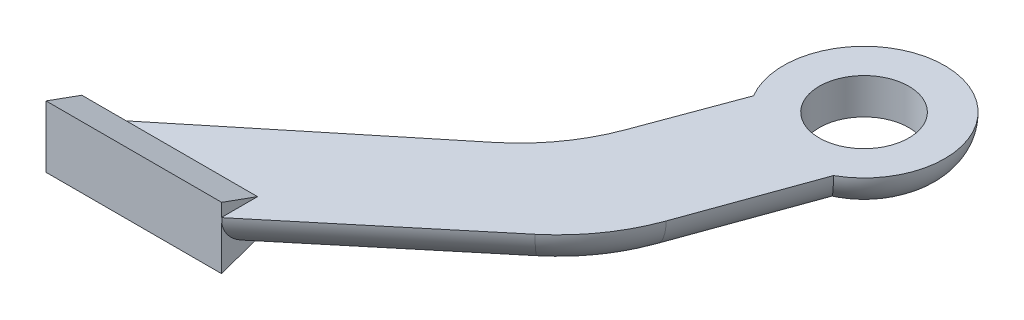
ISO-10303-21;
HEADER;
FILE_DESCRIPTION(('STEP AP214'),'2;1');
FILE_NAME('part.step','',(''),(''),'','','');
FILE_SCHEMA(('AUTOMOTIVE_DESIGN { 1 0 10303 214 1 1 1 1 }'));
ENDSEC;
DATA;
#1=APPLICATION_CONTEXT('core data for automotive mechanical design processes');
#2=APPLICATION_PROTOCOL_DEFINITION('international standard','automotive_design',2000,#1);
#3=PRODUCT_CONTEXT('',#1,'mechanical');
#4=PRODUCT('Part','Part','',(#3));
#5=PRODUCT_RELATED_PRODUCT_CATEGORY('part','',(#4));
#6=PRODUCT_DEFINITION_FORMATION('','',#4);
#7=PRODUCT_DEFINITION_CONTEXT('part definition',#1,'design');
#8=PRODUCT_DEFINITION('design','',#6,#7);
#9=PRODUCT_DEFINITION_SHAPE('','',#8);
#10=(LENGTH_UNIT() NAMED_UNIT(*) SI_UNIT(.MILLI.,.METRE.));
#11=(NAMED_UNIT(*) PLANE_ANGLE_UNIT() SI_UNIT($,.RADIAN.));
#12=(NAMED_UNIT(*) SI_UNIT($,.STERADIAN.) SOLID_ANGLE_UNIT());
#13=UNCERTAINTY_MEASURE_WITH_UNIT(LENGTH_MEASURE(1.E-05),#10,'distance_accuracy_value','');
#14=(GEOMETRIC_REPRESENTATION_CONTEXT(3) GLOBAL_UNCERTAINTY_ASSIGNED_CONTEXT((#13)) GLOBAL_UNIT_ASSIGNED_CONTEXT((#10,
#11,#12)) REPRESENTATION_CONTEXT('',''));
#15=CARTESIAN_POINT('',(0.,0.,0.));
#16=DIRECTION('',(0.,0.,1.));
#17=DIRECTION('',(1.,0.,0.));
#18=AXIS2_PLACEMENT_3D('',#15,#16,#17);
#19=CARTESIAN_POINT('',(11.4826257965562,2.,-14.3996307201945));
#20=DIRECTION('',(0.,1.,0.));
#21=DIRECTION('',(0.,0.,1.));
#22=AXIS2_PLACEMENT_3D('',#19,#20,#21);
#23=PLANE('',#22);
#24=DIRECTION('',(1.,0.,0.));
#25=VECTOR('',#24,1.);
#26=CARTESIAN_POINT('',(-11.15,2.,6.60036927980545));
#27=LINE('',#26,#25);
#28=CARTESIAN_POINT('',(-8.67203805305271,2.,6.60036927980545));
#29=VERTEX_POINT('',#28);
#30=CARTESIAN_POINT('',(-1.35,2.,6.60036927980545));
#31=VERTEX_POINT('',#30);
#32=EDGE_CURVE('E181',#29,#31,#27,.T.);
#33=ORIENTED_EDGE('',*,*,#32,.T.);
#34=DIRECTION('',(0.,0.,1.));
#35=VECTOR('',#34,1.);
#36=CARTESIAN_POINT('',(-1.35,2.,-14.3996307201945));
#37=LINE('',#36,#35);
#38=CARTESIAN_POINT('',(-1.35,2.,8.60036927980545));
#39=VERTEX_POINT('',#38);
#40=EDGE_CURVE('E178',#31,#39,#37,.T.);
#41=ORIENTED_EDGE('',*,*,#40,.T.);
#42=DIRECTION('',(1.,0.,0.));
#43=VECTOR('',#42,1.);
#44=CARTESIAN_POINT('',(-11.1234241734397,2.,8.60036927980545));
#45=LINE('',#44,#43);
#46=CARTESIAN_POINT('',(-1.31921636014026,2.,8.60036927980545));
#47=VERTEX_POINT('',#46);
#48=EDGE_CURVE('E199',#39,#47,#45,.T.);
#49=ORIENTED_EDGE('',*,*,#48,.T.);
#50=DIRECTION('',(0.768811989561023,0.,-0.639474881998676));
#51=VECTOR('',#50,1.);
#52=CARTESIAN_POINT('',(-1.31921636014026,2.,8.60036927980545));
#53=LINE('',#52,#51);
#54=CARTESIAN_POINT('',(8.20702119077927,2.,0.676729018622842));
#55=VERTEX_POINT('',#54);
#56=EDGE_CURVE('E202',#47,#55,#53,.T.);
#57=ORIENTED_EDGE('',*,*,#56,.T.);
#58=CARTESIAN_POINT('',(1.8122723707925,2.,-7.01139087698739));
#59=DIRECTION('',(0.,1.,0.));
#60=DIRECTION('',(0.,0.,1.));
#61=AXIS2_PLACEMENT_3D('',#58,#59,#60);
#62=CIRCLE('',#61,10.);
#63=CARTESIAN_POINT('',(11.2193056553227,2.,-3.6190871194002));
#64=VERTEX_POINT('',#63);
#65=EDGE_CURVE('E210',#55,#64,#62,.T.);
#66=ORIENTED_EDGE('',*,*,#65,.T.);
#67=DIRECTION('',(0.339230375758719,0.,-0.940703328453024));
#68=VECTOR('',#67,1.);
#69=CARTESIAN_POINT('',(10.2970860518292,2.,-1.06172459362196));
#70=LINE('',#69,#68);
#71=CARTESIAN_POINT('',(13.693514413313,2.,-10.4801956174922));
#72=VERTEX_POINT('',#71);
#73=EDGE_CURVE('E204',#64,#72,#70,.T.);
#74=ORIENTED_EDGE('',*,*,#73,.T.);
#75=CARTESIAN_POINT('',(11.4826257965562,2.,-14.3996307201945));
#76=DIRECTION('',(0.,1.,0.));
#77=DIRECTION('',(0.,0.,1.));
#78=AXIS2_PLACEMENT_3D('',#75,#76,#77);
#79=CIRCLE('',#78,4.5);
#80=CARTESIAN_POINT('',(7.61190342688268,2.,-12.1045254204515));
#81=VERTEX_POINT('',#80);
#82=EDGE_CURVE('E207',#72,#81,#79,.T.);
#83=ORIENTED_EDGE('',*,*,#82,.T.);
#84=DIRECTION('',(-0.347398248181745,0.,0.937717685212482));
#85=VECTOR('',#84,1.);
#86=CARTESIAN_POINT('',(7.61190342688268,2.,-12.1045254204515));
#87=LINE('',#86,#85);
#88=CARTESIAN_POINT('',(5.68031595775114,2.,-6.89067146517223));
#89=VERTEX_POINT('',#88);
#90=EDGE_CURVE('E190',#81,#89,#87,.T.);
#91=ORIENTED_EDGE('',*,*,#90,.T.);
#92=CARTESIAN_POINT('',(-3.69686089437368,2.,-10.3646539469897));
#93=DIRECTION('',(0.,1.,0.));
#94=DIRECTION('',(0.,0.,1.));
#95=AXIS2_PLACEMENT_3D('',#92,#93,#94);
#96=CIRCLE('',#95,10.);
#97=CARTESIAN_POINT('',(2.62475748019861,2.,-2.61629017608488));
#98=VERTEX_POINT('',#97);
#99=EDGE_CURVE('E212',#89,#98,#96,.F.);
#100=ORIENTED_EDGE('',*,*,#99,.T.);
#101=DIRECTION('',(-0.77483637709048,0.,0.632161837457229));
#102=VECTOR('',#101,1.);
#103=CARTESIAN_POINT('',(4.73443918794363,2.,-4.33750552457679));
#104=LINE('',#103,#102);
#105=EDGE_CURVE('E196',#98,#29,#104,.T.);
#106=ORIENTED_EDGE('',*,*,#105,.T.);
#107=EDGE_LOOP('',(#33,#41,#49,#57,#66,#74,#83,#91,#100,#106));
#108=FACE_BOUND('',#107,.T.);
#109=CARTESIAN_POINT('',(11.4826257965562,2.,-14.3996307201945));
#110=DIRECTION('',(0.,1.,0.));
#111=DIRECTION('',(0.,0.,1.));
#112=AXIS2_PLACEMENT_3D('',#109,#110,#111);
#113=CIRCLE('',#112,2.5);
#114=CARTESIAN_POINT('',(11.4826257965562,2.,-11.8996307201945));
#115=VERTEX_POINT('',#114);
#116=EDGE_CURVE('E187',#115,#115,#113,.T.);
#117=ORIENTED_EDGE('',*,*,#116,.F.);
#118=EDGE_LOOP('',(#117));
#119=FACE_BOUND('',#118,.T.);
#120=ADVANCED_FACE('F36',(#108,#119),#23,.T.);
#121=CARTESIAN_POINT('',(11.4826257965562,0.,-14.3996307201945));
#122=DIRECTION('',(0.,1.,0.));
#123=DIRECTION('',(0.,0.,1.));
#124=AXIS2_PLACEMENT_3D('',#121,#122,#123);
#125=PLANE('',#124);
#126=DIRECTION('',(-0.347398248181745,0.,0.937717685212482));
#127=VECTOR('',#126,1.);
#128=CARTESIAN_POINT('',(10.7021359294715,0.,-14.6887804470523));
#129=LINE('',#128,#127);
#130=CARTESIAN_POINT('',(7.5557513281761,0.,-6.19587496880874));
#131=VERTEX_POINT('',#130);
#132=CARTESIAN_POINT('',(9.88318716538032,0.,-12.4782260087654));
#133=VERTEX_POINT('',#132);
#134=EDGE_CURVE('E57',#131,#133,#129,.F.);
#135=ORIENTED_EDGE('',*,*,#134,.T.);
#136=CARTESIAN_POINT('',(11.4826257965562,0.,-14.3996307201945));
#137=DIRECTION('',(0.,1.,0.));
#138=DIRECTION('',(0.,0.,1.));
#139=AXIS2_PLACEMENT_3D('',#136,#137,#138);
#140=CIRCLE('',#139,2.5);
#141=CARTESIAN_POINT('',(12.1079729417804,0.,-11.9791057878793));
#142=VERTEX_POINT('',#141);
#143=EDGE_CURVE('E186',#133,#142,#140,.T.);
#144=ORIENTED_EDGE('',*,*,#143,.T.);
#145=DIRECTION('',(0.339230375758719,0.,-0.940703328453024));
#146=VECTOR('',#145,1.);
#147=CARTESIAN_POINT('',(12.8084358747006,0.,-13.921525628621));
#148=LINE('',#147,#146);
#149=CARTESIAN_POINT('',(9.3378989984167,0.,-4.29754787091764));
#150=VERTEX_POINT('',#149);
#151=EDGE_CURVE('E64',#142,#150,#148,.F.);
#152=ORIENTED_EDGE('',*,*,#151,.T.);
#153=CARTESIAN_POINT('',(1.8122723707925,0.,-7.01139087698739));
#154=DIRECTION('',(0.,1.,0.));
#155=DIRECTION('',(0.,0.,1.));
#156=AXIS2_PLACEMENT_3D('',#153,#154,#155);
#157=CIRCLE('',#156,8.);
#158=CARTESIAN_POINT('',(6.92807142678192,0.,-0.860894960499205));
#159=VERTEX_POINT('',#158);
#160=EDGE_CURVE('E221',#150,#159,#157,.F.);
#161=ORIENTED_EDGE('',*,*,#160,.T.);
#162=DIRECTION('',(0.768811989561023,0.,-0.639474881998676));
#163=VECTOR('',#162,1.);
#164=CARTESIAN_POINT('',(16.2762697216083,0.,-8.63644747873922));
#165=LINE('',#164,#163);
#166=CARTESIAN_POINT('',(-2.04227215778598,0.,6.60036927980545));
#167=VERTEX_POINT('',#166);
#168=EDGE_CURVE('E219',#159,#167,#165,.F.);
#169=ORIENTED_EDGE('',*,*,#168,.T.);
#170=DIRECTION('',(1.,0.,0.));
#171=VECTOR('',#170,1.);
#172=CARTESIAN_POINT('',(-11.15,0.,6.60036927980545));
#173=LINE('',#172,#171);
#174=CARTESIAN_POINT('',(-5.50829123776774,0.,6.60036927980545));
#175=VERTEX_POINT('',#174);
#176=EDGE_CURVE('E156',#175,#167,#173,.T.);
#177=ORIENTED_EDGE('',*,*,#176,.F.);
#178=DIRECTION('',(-0.77483637709048,0.,0.632161837457229));
#179=VECTOR('',#178,1.);
#180=CARTESIAN_POINT('',(14.9788313460514,0.,-10.1143558411684));
#181=LINE('',#180,#179);
#182=CARTESIAN_POINT('',(3.88908115511307,0.,-1.06661742190392));
#183=VERTEX_POINT('',#182);
#184=EDGE_CURVE('E214',#175,#183,#181,.F.);
#185=ORIENTED_EDGE('',*,*,#184,.T.);
#186=CARTESIAN_POINT('',(-3.69686089437368,0.,-10.3646539469897));
#187=DIRECTION('',(0.,1.,0.));
#188=DIRECTION('',(0.,0.,1.));
#189=AXIS2_PLACEMENT_3D('',#186,#187,#188);
#190=CIRCLE('',#189,12.);
#191=EDGE_CURVE('E216',#183,#131,#190,.T.);
#192=ORIENTED_EDGE('',*,*,#191,.T.);
#193=EDGE_LOOP('',(#135,#144,#152,#161,#169,#177,#185,#192));
#194=FACE_BOUND('',#193,.T.);
#195=ADVANCED_FACE('F265',(#194),#125,.F.);
#196=CARTESIAN_POINT('',(-11.1234241734397,2.,8.60036927980545));
#197=DIRECTION('',(0.,0.,-1.));
#198=DIRECTION('',(-1.,0.,0.));
#199=AXIS2_PLACEMENT_3D('',#196,#197,#198);
#200=PLANE('',#199);
#201=DIRECTION('',(0.,-1.,0.));
#202=VECTOR('',#201,1.);
#203=CARTESIAN_POINT('',(-1.35,-0.725,8.60036927980545));
#204=LINE('',#203,#202);
#205=CARTESIAN_POINT('',(-1.35,1.72008225440629,8.60036927980545));
#206=VERTEX_POINT('',#205);
#207=CARTESIAN_POINT('',(-1.35,-0.725,8.60036927980545));
#208=VERTEX_POINT('',#207);
#209=EDGE_CURVE('E135',#206,#208,#204,.T.);
#210=ORIENTED_EDGE('',*,*,#209,.F.);
#211=CARTESIAN_POINT('',(-4.44678251840594,2.,8.60036927980545));
#212=DIRECTION('',(0.,0.,-1.));
#213=DIRECTION('',(1.,0.,0.));
#214=AXIS2_PLACEMENT_3D('',#211,#212,#213);
#215=ELLIPSE('',#214,3.12756615826568,2.);
#216=EDGE_CURVE('E224',#206,#47,#215,.F.);
#217=ORIENTED_EDGE('',*,*,#216,.T.);
#218=ORIENTED_EDGE('',*,*,#48,.F.);
#219=CARTESIAN_POINT('',(-1.35,2.725,8.60036927980545));
#220=VERTEX_POINT('',#219);
#221=EDGE_CURVE('E145',#220,#39,#204,.T.);
#222=ORIENTED_EDGE('',*,*,#221,.F.);
#223=DIRECTION('',(1.,0.,0.));
#224=VECTOR('',#223,1.);
#225=CARTESIAN_POINT('',(-11.15,2.725,8.60036927980545));
#226=LINE('',#225,#224);
#227=CARTESIAN_POINT('',(-11.15,2.725,8.60036927980545));
#228=VERTEX_POINT('',#227);
#229=EDGE_CURVE('E176',#228,#220,#226,.T.);
#230=ORIENTED_EDGE('',*,*,#229,.F.);
#231=DIRECTION('',(0.,-1.,0.));
#232=VECTOR('',#231,1.);
#233=CARTESIAN_POINT('',(-11.15,-0.725,8.60036927980545));
#234=LINE('',#233,#232);
#235=CARTESIAN_POINT('',(-11.15,-0.725,8.60036927980545));
#236=VERTEX_POINT('',#235);
#237=EDGE_CURVE('E152',#228,#236,#234,.T.);
#238=ORIENTED_EDGE('',*,*,#237,.T.);
#239=DIRECTION('',(1.,0.,0.));
#240=VECTOR('',#239,1.);
#241=CARTESIAN_POINT('',(-11.15,-0.725,8.60036927980545));
#242=LINE('',#241,#240);
#243=EDGE_CURVE('E149',#236,#208,#242,.T.);
#244=ORIENTED_EDGE('',*,*,#243,.T.);
#245=EDGE_LOOP('',(#210,#217,#218,#222,#230,#238,#244));
#246=FACE_BOUND('',#245,.T.);
#247=ADVANCED_FACE('F150',(#246),#200,.F.);
#248=CARTESIAN_POINT('',(11.4826257965562,2.,-14.3996307201945));
#249=DIRECTION('',(0.,-1.,0.));
#250=DIRECTION('',(0.,0.,-1.));
#251=AXIS2_PLACEMENT_3D('',#248,#249,#250);
#252=CYLINDRICAL_SURFACE('',#251,2.5);
#253=ORIENTED_EDGE('',*,*,#116,.T.);
#254=EDGE_LOOP('',(#253));
#255=FACE_BOUND('',#254,.T.);
#256=EDGE_CURVE('E191',#142,#133,#140,.T.);
#257=ORIENTED_EDGE('',*,*,#256,.F.);
#258=ORIENTED_EDGE('',*,*,#143,.F.);
#259=EDGE_LOOP('',(#257,#258));
#260=FACE_BOUND('',#259,.T.);
#261=ADVANCED_FACE('F275',(#255,#260),#252,.F.);
#262=CARTESIAN_POINT('',(-11.15,2.,6.60036927980545));
#263=DIRECTION('',(0.,0.,-1.));
#264=DIRECTION('',(-1.,0.,0.));
#265=AXIS2_PLACEMENT_3D('',#262,#263,#264);
#266=PLANE('',#265);
#267=CARTESIAN_POINT('',(-11.15,2.,6.60036927980545));
#268=VERTEX_POINT('',#267);
#269=EDGE_CURVE('E179',#268,#29,#27,.T.);
#270=ORIENTED_EDGE('',*,*,#269,.T.);
#271=CARTESIAN_POINT('',(-5.50829123776774,2.,6.60036927980545));
#272=DIRECTION('',(0.,0.,-1.));
#273=DIRECTION('',(-1.,0.,0.));
#274=AXIS2_PLACEMENT_3D('',#271,#272,#273);
#275=ELLIPSE('',#274,3.16374681528496,2.);
#276=EDGE_CURVE('E228',#29,#175,#275,.F.);
#277=ORIENTED_EDGE('',*,*,#276,.T.);
#278=CARTESIAN_POINT('',(-11.15,0.,6.60036927980545));
#279=VERTEX_POINT('',#278);
#280=EDGE_CURVE('E182',#279,#175,#173,.T.);
#281=ORIENTED_EDGE('',*,*,#280,.F.);
#282=DIRECTION('',(0.,1.,0.));
#283=VECTOR('',#282,1.);
#284=CARTESIAN_POINT('',(-11.15,2.,6.60036927980545));
#285=LINE('',#284,#283);
#286=EDGE_CURVE('E171',#279,#268,#285,.T.);
#287=ORIENTED_EDGE('',*,*,#286,.T.);
#288=EDGE_LOOP('',(#270,#277,#281,#287));
#289=FACE_BOUND('',#288,.T.);
#290=ADVANCED_FACE('F296',(#289),#266,.T.);
#291=CARTESIAN_POINT('',(-1.35,0.,0.));
#292=DIRECTION('',(-1.,0.,0.));
#293=DIRECTION('',(0.,0.,1.));
#294=AXIS2_PLACEMENT_3D('',#291,#292,#293);
#295=PLANE('',#294);
#296=DIRECTION('',(0.,0.3407993236214,-0.940136065162483));
#297=VECTOR('',#296,1.);
#298=CARTESIAN_POINT('',(-1.35,0.,6.60036927980545));
#299=LINE('',#298,#297);
#300=CARTESIAN_POINT('',(-1.35,0.0344519870253964,6.50532931559746));
#301=VERTEX_POINT('',#300);
#302=EDGE_CURVE('E139',#208,#301,#299,.T.);
#303=ORIENTED_EDGE('',*,*,#302,.T.);
#304=CARTESIAN_POINT('',(-1.35,2.,6.0245579469672));
#305=DIRECTION('',(-1.,0.,0.));
#306=DIRECTION('',(0.,0.,-1.));
#307=AXIS2_PLACEMENT_3D('',#304,#305,#306);
#308=ELLIPSE('',#307,2.60141624630745,2.);
#309=EDGE_CURVE('E142',#301,#206,#308,.T.);
#310=ORIENTED_EDGE('',*,*,#309,.T.);
#311=ORIENTED_EDGE('',*,*,#209,.T.);
#312=EDGE_LOOP('',(#303,#310,#311));
#313=FACE_BOUND('',#312,.T.);
#314=ADVANCED_FACE('F137',(#313),#295,.F.);
#315=CARTESIAN_POINT('',(-11.15,2.725,8.60036927980545));
#316=DIRECTION('',(0.,0.940136065162483,-0.3407993236214));
#317=DIRECTION('',(0.,0.3407993236214,0.940136065162483));
#318=AXIS2_PLACEMENT_3D('',#315,#316,#317);
#319=PLANE('',#318);
#320=ORIENTED_EDGE('',*,*,#229,.T.);
#321=DIRECTION('',(0.,0.3407993236214,0.940136065162483));
#322=VECTOR('',#321,1.);
#323=CARTESIAN_POINT('',(-1.35,2.725,8.60036927980545));
#324=LINE('',#323,#322);
#325=EDGE_CURVE('E163',#31,#220,#324,.T.);
#326=ORIENTED_EDGE('',*,*,#325,.F.);
#327=ORIENTED_EDGE('',*,*,#32,.F.);
#328=ORIENTED_EDGE('',*,*,#269,.F.);
#329=DIRECTION('',(0.,0.3407993236214,0.940136065162483));
#330=VECTOR('',#329,1.);
#331=CARTESIAN_POINT('',(-11.15,2.725,8.60036927980545));
#332=LINE('',#331,#330);
#333=EDGE_CURVE('E157',#268,#228,#332,.T.);
#334=ORIENTED_EDGE('',*,*,#333,.T.);
#335=EDGE_LOOP('',(#320,#326,#327,#328,#334));
#336=FACE_BOUND('',#335,.T.);
#337=ADVANCED_FACE('F302',(#336),#319,.T.);
#338=CARTESIAN_POINT('',(-11.15,0.,6.60036927980545));
#339=DIRECTION('',(0.,-0.940136065162483,-0.3407993236214));
#340=DIRECTION('',(0.,0.3407993236214,-0.940136065162483));
#341=AXIS2_PLACEMENT_3D('',#338,#339,#340);
#342=PLANE('',#341);
#343=ORIENTED_EDGE('',*,*,#280,.T.);
#344=ORIENTED_EDGE('',*,*,#176,.T.);
#345=CARTESIAN_POINT('',(4.59085987151048,2.,1.0831279004951));
#346=DIRECTION('',(0.,-0.940136065162483,-0.3407993236214));
#347=DIRECTION('',(0.787746403612043,0.209932273696439,-0.57912351364535));
#348=AXIS2_PLACEMENT_3D('',#345,#346,#347);
#349=ELLIPSE('',#348,9.17714895977948,2.);
#350=EDGE_CURVE('E162',#167,#301,#349,.F.);
#351=ORIENTED_EDGE('',*,*,#350,.T.);
#352=ORIENTED_EDGE('',*,*,#302,.F.);
#353=ORIENTED_EDGE('',*,*,#243,.F.);
#354=DIRECTION('',(0.,0.3407993236214,-0.940136065162483));
#355=VECTOR('',#354,1.);
#356=CARTESIAN_POINT('',(-11.15,0.,6.60036927980545));
#357=LINE('',#356,#355);
#358=EDGE_CURVE('E169',#236,#279,#357,.T.);
#359=ORIENTED_EDGE('',*,*,#358,.T.);
#360=EDGE_LOOP('',(#343,#344,#351,#352,#353,#359));
#361=FACE_BOUND('',#360,.T.);
#362=ADVANCED_FACE('F159',(#361),#342,.T.);
#363=CARTESIAN_POINT('',(-11.15,0.,0.));
#364=DIRECTION('',(-1.,0.,0.));
#365=DIRECTION('',(0.,0.,1.));
#366=AXIS2_PLACEMENT_3D('',#363,#364,#365);
#367=PLANE('',#366);
#368=ORIENTED_EDGE('',*,*,#237,.F.);
#369=ORIENTED_EDGE('',*,*,#333,.F.);
#370=ORIENTED_EDGE('',*,*,#286,.F.);
#371=ORIENTED_EDGE('',*,*,#358,.F.);
#372=EDGE_LOOP('',(#368,#369,#370,#371));
#373=FACE_BOUND('',#372,.T.);
#374=ADVANCED_FACE('F300',(#373),#367,.T.);
#375=ORIENTED_EDGE('',*,*,#40,.F.);
#376=ORIENTED_EDGE('',*,*,#325,.T.);
#377=ORIENTED_EDGE('',*,*,#221,.T.);
#378=EDGE_LOOP('',(#375,#376,#377));
#379=FACE_BOUND('',#378,.T.);
#380=ADVANCED_FACE('F285',(#379),#295,.F.);
#381=CARTESIAN_POINT('',(-2.59816612413761,2.,7.0627453006834));
#382=DIRECTION('',(0.768811989561023,0.,-0.639474881998676));
#383=DIRECTION('',(-0.639474881998676,0.,-0.768811989561023));
#384=AXIS2_PLACEMENT_3D('',#381,#382,#383);
#385=CYLINDRICAL_SURFACE('',#384,2.);
#386=ORIENTED_EDGE('',*,*,#350,.F.);
#387=ORIENTED_EDGE('',*,*,#168,.F.);
#388=CARTESIAN_POINT('',(6.92807142678192,2.,-0.860894960499205));
#389=DIRECTION('',(0.768811989561023,0.,-0.639474881998676));
#390=DIRECTION('',(-0.639474881998676,0.,-0.768811989561023));
#391=AXIS2_PLACEMENT_3D('',#388,#389,#390);
#392=CIRCLE('',#391,2.);
#393=EDGE_CURVE('E146',#55,#159,#392,.T.);
#394=ORIENTED_EDGE('',*,*,#393,.F.);
#395=ORIENTED_EDGE('',*,*,#56,.F.);
#396=ORIENTED_EDGE('',*,*,#216,.F.);
#397=ORIENTED_EDGE('',*,*,#309,.F.);
#398=EDGE_LOOP('',(#386,#387,#394,#395,#396,#397));
#399=FACE_BOUND('',#398,.T.);
#400=ADVANCED_FACE('F251',(#399),#385,.T.);
#401=CARTESIAN_POINT('',(1.8122723707925,2.,-7.01139087698739));
#402=DIRECTION('',(0.,1.,0.));
#403=DIRECTION('',(0.,0.,1.));
#404=AXIS2_PLACEMENT_3D('',#401,#402,#403);
#405=TOROIDAL_SURFACE('',#404,8.,2.);
#406=ORIENTED_EDGE('',*,*,#393,.T.);
#407=ORIENTED_EDGE('',*,*,#160,.F.);
#408=CARTESIAN_POINT('',(9.3378989984167,2.,-4.29754787091764));
#409=DIRECTION('',(0.339230375758719,0.,-0.940703328453024));
#410=DIRECTION('',(-0.940703328453024,0.,-0.339230375758719));
#411=AXIS2_PLACEMENT_3D('',#408,#409,#410);
#412=CIRCLE('',#411,2.);
#413=EDGE_CURVE('E231',#64,#150,#412,.T.);
#414=ORIENTED_EDGE('',*,*,#413,.F.);
#415=ORIENTED_EDGE('',*,*,#65,.F.);
#416=EDGE_LOOP('',(#406,#407,#414,#415));
#417=FACE_BOUND('',#416,.T.);
#418=ADVANCED_FACE('F262',(#417),#405,.T.);
#419=CARTESIAN_POINT('',(8.41567939492314,2.,-1.7401853451394));
#420=DIRECTION('',(0.339230375758719,0.,-0.940703328453024));
#421=DIRECTION('',(-0.940703328453024,0.,-0.339230375758719));
#422=AXIS2_PLACEMENT_3D('',#419,#420,#421);
#423=CYLINDRICAL_SURFACE('',#422,2.);
#424=ORIENTED_EDGE('',*,*,#413,.T.);
#425=ORIENTED_EDGE('',*,*,#151,.F.);
#426=CARTESIAN_POINT('',(13.693514413313,2.,-10.4801956174922));
#427=CARTESIAN_POINT('',(13.6935206015833,1.94647094845797,-10.4801920632802));
#428=CARTESIAN_POINT('',(13.6917636364918,1.89294525970464,-10.4816752709105));
#429=CARTESIAN_POINT('',(13.6847706272418,1.78629295991481,-10.4875874777269));
#430=CARTESIAN_POINT('',(13.6795350977507,1.7331662910175,-10.4920160411361));
#431=CARTESIAN_POINT('',(13.6656469622341,1.62780060898106,-10.5037787069259));
#432=CARTESIAN_POINT('',(13.6570016554297,1.57555994672415,-10.5111066028867));
#433=CARTESIAN_POINT('',(13.6363943848645,1.47223655971397,-10.5286070655638));
#434=CARTESIAN_POINT('',(13.6244323997996,1.42115384240081,-10.5387796505525));
#435=CARTESIAN_POINT('',(13.5837393605981,1.27018038251834,-10.5734676457845));
#436=CARTESIAN_POINT('',(13.5501882878966,1.17246774766914,-10.6021641468197));
#437=CARTESIAN_POINT('',(13.4716192624409,0.985678518852981,-10.6698749951854));
#438=CARTESIAN_POINT('',(13.4265992827097,0.896603455308139,-10.7088911664272));
#439=CARTESIAN_POINT('',(13.3257203823923,0.727334799373857,-10.7971814060579));
#440=CARTESIAN_POINT('',(13.2696490582893,0.647373586018656,-10.8466581543752));
#441=CARTESIAN_POINT('',(13.1493973648619,0.500311076124678,-10.9541068178581));
#442=CARTESIAN_POINT('',(13.0852150322487,0.433212903045907,-11.0120807903417));
#443=CARTESIAN_POINT('',(12.9471257908999,0.309609195597523,-11.1387261646872));
#444=CARTESIAN_POINT('',(12.8728736116376,0.253921664797636,-11.2078181125366));
#445=CARTESIAN_POINT('',(12.7203459894761,0.158907196256941,-11.3525316463373));
#446=CARTESIAN_POINT('',(12.6420687196115,0.119587762876743,-11.4281562081838));
#447=CARTESIAN_POINT('',(12.4882816488727,0.0591602497511942,-11.5802164512471));
#448=CARTESIAN_POINT('',(12.412847993636,0.0371900149889169,-11.6563920333859));
#449=CARTESIAN_POINT('',(12.2627109958039,0.0078428192906722,-11.811982496122));
#450=CARTESIAN_POINT('',(12.1880065576385,0.000438850248578032,-11.891391102499));
#451=CARTESIAN_POINT('',(12.11239205861,6.29203840483205E-06,-11.9742562173392));
#452=CARTESIAN_POINT('',(12.1101818959228,-1.95465007629301E-08,-11.9766805427118));
#453=CARTESIAN_POINT('',(12.1079729417804,0.,-11.9791057878793));
#454=B_SPLINE_CURVE_WITH_KNOTS('',3,(#426,#427,#428,#429,#430,#431,#432,#433,#434,#435,#436,
#437,#438,#439,#440,#441,#442,#443,#444,#445,#446,#447,#448,#449,#450,#451,#452,#453),
.UNSPECIFIED.,.F.,.F.,(4,2,2,2,2,2,2,2,2,2,2,2,2,4),(0.,0.16053195849016,0.321040170924062,
0.481206636430516,0.641374130760215,0.961418689782529,1.28151985172015,1.60850954501276,
1.93557853908486,2.28122266166902,2.62702507931526,2.95431744541945,3.28100238685324,
3.29084409847999),.UNSPECIFIED.);
#455=EDGE_CURVE('E11',#142,#72,#454,.F.);
#456=ORIENTED_EDGE('',*,*,#455,.T.);
#457=ORIENTED_EDGE('',*,*,#73,.F.);
#458=EDGE_LOOP('',(#424,#425,#456,#457));
#459=FACE_BOUND('',#458,.T.);
#460=ADVANCED_FACE('F257',(#459),#423,.T.);
#461=CARTESIAN_POINT('',(5.99876286285809,2.,-2.78783277039583));
#462=DIRECTION('',(-0.77483637709048,0.,0.632161837457229));
#463=DIRECTION('',(0.632161837457229,0.,0.77483637709048));
#464=AXIS2_PLACEMENT_3D('',#461,#462,#463);
#465=CYLINDRICAL_SURFACE('',#464,2.);
#466=ORIENTED_EDGE('',*,*,#276,.F.);
#467=ORIENTED_EDGE('',*,*,#105,.F.);
#468=CARTESIAN_POINT('',(3.88908115511307,2.,-1.06661742190392));
#469=DIRECTION('',(0.77483637709048,0.,-0.632161837457229));
#470=DIRECTION('',(-0.632161837457229,0.,-0.77483637709048));
#471=AXIS2_PLACEMENT_3D('',#468,#469,#470);
#472=CIRCLE('',#471,2.);
#473=EDGE_CURVE('E233',#183,#98,#472,.T.);
#474=ORIENTED_EDGE('',*,*,#473,.F.);
#475=ORIENTED_EDGE('',*,*,#184,.F.);
#476=EDGE_LOOP('',(#466,#467,#474,#475));
#477=FACE_BOUND('',#476,.T.);
#478=ADVANCED_FACE('F254',(#477),#465,.T.);
#479=CARTESIAN_POINT('',(-3.69686089437368,2.,-10.3646539469897));
#480=DIRECTION('',(0.,1.,0.));
#481=DIRECTION('',(0.,0.,1.));
#482=AXIS2_PLACEMENT_3D('',#479,#480,#481);
#483=TOROIDAL_SURFACE('',#482,12.,2.);
#484=ORIENTED_EDGE('',*,*,#473,.T.);
#485=ORIENTED_EDGE('',*,*,#99,.F.);
#486=CARTESIAN_POINT('',(7.5557513281761,2.,-6.19587496880874));
#487=DIRECTION('',(0.347398248181745,0.,-0.937717685212482));
#488=DIRECTION('',(-0.937717685212482,0.,-0.347398248181745));
#489=AXIS2_PLACEMENT_3D('',#486,#487,#488);
#490=CIRCLE('',#489,2.);
#491=EDGE_CURVE('E236',#131,#89,#490,.T.);
#492=ORIENTED_EDGE('',*,*,#491,.F.);
#493=ORIENTED_EDGE('',*,*,#191,.F.);
#494=EDGE_LOOP('',(#484,#485,#492,#493));
#495=FACE_BOUND('',#494,.T.);
#496=ADVANCED_FACE('F249',(#495),#483,.T.);
#497=CARTESIAN_POINT('',(9.48733879730765,2.,-11.409728924088));
#498=DIRECTION('',(-0.347398248181745,0.,0.937717685212482));
#499=DIRECTION('',(0.937717685212482,0.,0.347398248181745));
#500=AXIS2_PLACEMENT_3D('',#497,#498,#499);
#501=CYLINDRICAL_SURFACE('',#500,2.);
#502=ORIENTED_EDGE('',*,*,#90,.F.);
#503=CARTESIAN_POINT('',(7.61190342688268,2.,-12.1045254204515));
#504=CARTESIAN_POINT('',(7.61189543352078,1.94797161246337,-12.1045262232534));
#505=CARTESIAN_POINT('',(7.61414339430645,1.89594703558025,-12.1047280739774));
#506=CARTESIAN_POINT('',(7.62308994926808,1.79229556153906,-12.105539429095));
#507=CARTESIAN_POINT('',(7.62978763009234,1.74066858496881,-12.1061488498307));
#508=CARTESIAN_POINT('',(7.6475467799877,1.63832832712275,-12.1077785477575));
#509=CARTESIAN_POINT('',(7.65859562252087,1.58761284216087,-12.1087976363189));
#510=CARTESIAN_POINT('',(7.68492912514579,1.48731807740263,-12.1112567415172));
#511=CARTESIAN_POINT('',(7.70021385815536,1.43773881718148,-12.1126967654001));
#512=CARTESIAN_POINT('',(7.75219834246821,1.29125228992072,-12.1176685979388));
#513=CARTESIAN_POINT('',(7.79504999413708,1.19647368864975,-12.1218540280005));
#514=CARTESIAN_POINT('',(7.89544489323164,1.01521923926278,-12.1321135387336));
#515=CARTESIAN_POINT('',(7.95299390003438,0.928746664308471,-12.1381883599949));
#516=CARTESIAN_POINT('',(8.08277301030972,0.76331630024433,-12.1526471361493));
#517=CARTESIAN_POINT('',(8.15541305794058,0.68468644081365,-12.1610986019576));
#518=CARTESIAN_POINT('',(8.31166308370237,0.539619289635113,-12.1804522363457));
#519=CARTESIAN_POINT('',(8.39527542737518,0.473184634508815,-12.1913549337545));
#520=CARTESIAN_POINT('',(8.57861945643107,0.348091659981006,-12.2169281844484));
#521=CARTESIAN_POINT('',(8.67912074017512,0.290613681895938,-12.23184411115));
#522=CARTESIAN_POINT('',(8.88709032135319,0.191352219674169,-12.2651943235526));
#523=CARTESIAN_POINT('',(8.99456485297788,0.149583012573472,-12.2836317869956));
#524=CARTESIAN_POINT('',(9.22965456264571,0.0765945474507016,-12.327317552917));
#525=CARTESIAN_POINT('',(9.35791266490508,0.0478193952913946,-12.3531680620895));
#526=CARTESIAN_POINT('',(9.61586564248933,0.00975062089641697,-12.4103304088893));
#527=CARTESIAN_POINT('',(9.74555771894424,0.000424111407126259,-12.4416329299717));
#528=CARTESIAN_POINT('',(9.87725407027953,4.69634166260889E-06,-12.4766436593888));
#529=CARTESIAN_POINT('',(9.88022088463565,-1.59677907326687E-08,-12.4774340574169));
#530=CARTESIAN_POINT('',(9.88318716538032,0.,-12.4782260087654));
#531=B_SPLINE_CURVE_WITH_KNOTS('',3,(#503,#504,#505,#506,#507,#508,#509,#510,#511,#512,#513,
#514,#515,#516,#517,#518,#519,#520,#521,#522,#523,#524,#525,#526,#527,#528,#529,#530),
.UNSPECIFIED.,.F.,.F.,(4,2,2,2,2,2,2,2,2,2,2,2,2,4),(0.,0.156029713161231,0.312027409478255,
0.467575716396317,0.62312670113319,0.933859930965682,1.24471511357013,1.5654916485293,
1.88633745438656,2.23511270915112,2.58420418928672,2.98446938566176,3.38405719116916,
3.39326806890228),.UNSPECIFIED.);
#532=EDGE_CURVE('E50',#81,#133,#531,.T.);
#533=ORIENTED_EDGE('',*,*,#532,.T.);
#534=ORIENTED_EDGE('',*,*,#134,.F.);
#535=ORIENTED_EDGE('',*,*,#491,.T.);
#536=EDGE_LOOP('',(#502,#533,#534,#535));
#537=FACE_BOUND('',#536,.T.);
#538=ADVANCED_FACE('F244',(#537),#501,.T.);
#539=CARTESIAN_POINT('',(11.4826257965562,2.,-14.3996307201945));
#540=DIRECTION('',(0.,1.,0.));
#541=DIRECTION('',(0.,0.,1.));
#542=AXIS2_PLACEMENT_3D('',#539,#540,#541);
#543=TOROIDAL_SURFACE('',#542,2.5,2.);
#544=ORIENTED_EDGE('',*,*,#455,.F.);
#545=ORIENTED_EDGE('',*,*,#256,.T.);
#546=ORIENTED_EDGE('',*,*,#532,.F.);
#547=ORIENTED_EDGE('',*,*,#82,.F.);
#548=EDGE_LOOP('',(#544,#545,#546,#547));
#549=FACE_BOUND('',#548,.T.);
#550=ADVANCED_FACE('F38',(#549),#543,.T.);
#551=CLOSED_SHELL('',(#120,#195,#247,#261,#290,#314,#337,#362,#374,#380,#400,#418,#460,#478,
#496,#538,#550));
#552=MANIFOLD_SOLID_BREP('B2',#551);
#553=ADVANCED_BREP_SHAPE_REPRESENTATION('',(#18,#552),#14);
#554=SHAPE_DEFINITION_REPRESENTATION(#9,#553);
ENDSEC;
END-ISO-10303-21;
